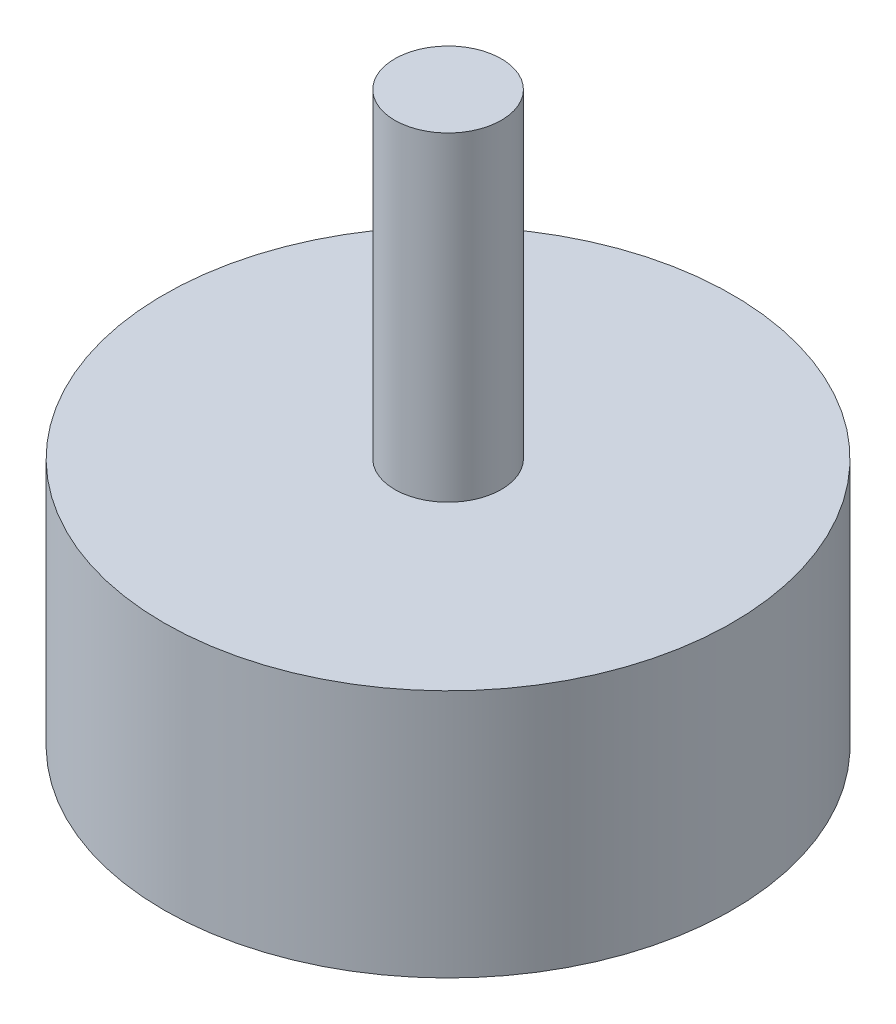
ISO-10303-21;
HEADER;
FILE_DESCRIPTION(('STEP AP214'),'2;1');
FILE_NAME('part.step','',(''),(''),'','','');
FILE_SCHEMA(('AUTOMOTIVE_DESIGN { 1 0 10303 214 1 1 1 1 }'));
ENDSEC;
DATA;
#1=APPLICATION_CONTEXT('core data for automotive mechanical design processes');
#2=APPLICATION_PROTOCOL_DEFINITION('international standard','automotive_design',2000,#1);
#3=PRODUCT_CONTEXT('',#1,'mechanical');
#4=PRODUCT('Part','Part','',(#3));
#5=PRODUCT_RELATED_PRODUCT_CATEGORY('part','',(#4));
#6=PRODUCT_DEFINITION_FORMATION('','',#4);
#7=PRODUCT_DEFINITION_CONTEXT('part definition',#1,'design');
#8=PRODUCT_DEFINITION('design','',#6,#7);
#9=PRODUCT_DEFINITION_SHAPE('','',#8);
#10=(LENGTH_UNIT() NAMED_UNIT(*) SI_UNIT(.MILLI.,.METRE.));
#11=(NAMED_UNIT(*) PLANE_ANGLE_UNIT() SI_UNIT($,.RADIAN.));
#12=(NAMED_UNIT(*) SI_UNIT($,.STERADIAN.) SOLID_ANGLE_UNIT());
#13=UNCERTAINTY_MEASURE_WITH_UNIT(LENGTH_MEASURE(1.E-05),#10,'distance_accuracy_value','');
#14=(GEOMETRIC_REPRESENTATION_CONTEXT(3) GLOBAL_UNCERTAINTY_ASSIGNED_CONTEXT((#13)) GLOBAL_UNIT_ASSIGNED_CONTEXT((#10,
#11,#12)) REPRESENTATION_CONTEXT('',''));
#15=CARTESIAN_POINT('',(0.,0.,0.));
#16=DIRECTION('',(0.,0.,1.));
#17=DIRECTION('',(1.,0.,0.));
#18=AXIS2_PLACEMENT_3D('',#15,#16,#17);
#19=CARTESIAN_POINT('',(0.,11.1125,0.));
#20=DIRECTION('',(0.,1.,0.));
#21=DIRECTION('',(0.,0.,1.));
#22=AXIS2_PLACEMENT_3D('',#19,#20,#21);
#23=PLANE('',#22);
#24=CARTESIAN_POINT('',(0.,11.1125,0.));
#25=DIRECTION('',(0.,1.,0.));
#26=DIRECTION('',(0.,0.,1.));
#27=AXIS2_PLACEMENT_3D('',#24,#25,#26);
#28=CIRCLE('',#27,25.4);
#29=CARTESIAN_POINT('',(0.,11.1125,25.4));
#30=VERTEX_POINT('',#29);
#31=EDGE_CURVE('E12',#30,#30,#28,.T.);
#32=ORIENTED_EDGE('',*,*,#31,.T.);
#33=EDGE_LOOP('',(#32));
#34=FACE_BOUND('',#33,.T.);
#35=CARTESIAN_POINT('',(0.,11.1125,0.));
#36=DIRECTION('',(0.,1.,0.));
#37=DIRECTION('',(0.,0.,1.));
#38=AXIS2_PLACEMENT_3D('',#35,#36,#37);
#39=CIRCLE('',#38,4.7625);
#40=CARTESIAN_POINT('',(0.,11.1125,4.7625));
#41=VERTEX_POINT('',#40);
#42=EDGE_CURVE('E49',#41,#41,#39,.T.);
#43=ORIENTED_EDGE('',*,*,#42,.F.);
#44=EDGE_LOOP('',(#43));
#45=FACE_BOUND('',#44,.T.);
#46=ADVANCED_FACE('F36',(#34,#45),#23,.T.);
#47=CARTESIAN_POINT('',(0.,11.1125,0.));
#48=DIRECTION('',(0.,-1.,0.));
#49=DIRECTION('',(0.,0.,-1.));
#50=AXIS2_PLACEMENT_3D('',#47,#48,#49);
#51=CYLINDRICAL_SURFACE('',#50,25.4);
#52=ORIENTED_EDGE('',*,*,#31,.F.);
#53=EDGE_LOOP('',(#52));
#54=FACE_BOUND('',#53,.T.);
#55=CARTESIAN_POINT('',(0.,-11.1125,0.));
#56=DIRECTION('',(0.,1.,0.));
#57=DIRECTION('',(0.,0.,1.));
#58=AXIS2_PLACEMENT_3D('',#55,#56,#57);
#59=CIRCLE('',#58,25.4);
#60=CARTESIAN_POINT('',(0.,-11.1125,25.4));
#61=VERTEX_POINT('',#60);
#62=EDGE_CURVE('E40',#61,#61,#59,.T.);
#63=ORIENTED_EDGE('',*,*,#62,.T.);
#64=EDGE_LOOP('',(#63));
#65=FACE_BOUND('',#64,.T.);
#66=ADVANCED_FACE('F38',(#54,#65),#51,.T.);
#67=CARTESIAN_POINT('',(0.,-11.1125,0.));
#68=DIRECTION('',(0.,1.,0.));
#69=DIRECTION('',(0.,0.,1.));
#70=AXIS2_PLACEMENT_3D('',#67,#68,#69);
#71=PLANE('',#70);
#72=CARTESIAN_POINT('',(0.,-11.1125,0.));
#73=DIRECTION('',(0.,1.,0.));
#74=DIRECTION('',(0.,0.,1.));
#75=AXIS2_PLACEMENT_3D('',#72,#73,#74);
#76=CIRCLE('',#75,4.7625);
#77=CARTESIAN_POINT('',(0.,-11.1125,4.7625));
#78=VERTEX_POINT('',#77);
#79=EDGE_CURVE('E52',#78,#78,#76,.T.);
#80=ORIENTED_EDGE('',*,*,#79,.T.);
#81=EDGE_LOOP('',(#80));
#82=FACE_BOUND('',#81,.T.);
#83=ORIENTED_EDGE('',*,*,#62,.F.);
#84=EDGE_LOOP('',(#83));
#85=FACE_BOUND('',#84,.T.);
#86=ADVANCED_FACE('F70',(#82,#85),#71,.F.);
#87=CARTESIAN_POINT('',(0.,39.6875,0.));
#88=DIRECTION('',(0.,-1.,0.));
#89=DIRECTION('',(0.,0.,-1.));
#90=AXIS2_PLACEMENT_3D('',#87,#88,#89);
#91=CYLINDRICAL_SURFACE('',#90,4.7625);
#92=CARTESIAN_POINT('',(0.,39.6875,0.));
#93=DIRECTION('',(0.,1.,0.));
#94=DIRECTION('',(0.,0.,1.));
#95=AXIS2_PLACEMENT_3D('',#92,#93,#94);
#96=CIRCLE('',#95,4.7625);
#97=CARTESIAN_POINT('',(0.,39.6875,4.7625));
#98=VERTEX_POINT('',#97);
#99=EDGE_CURVE('E47',#98,#98,#96,.T.);
#100=ORIENTED_EDGE('',*,*,#99,.F.);
#101=EDGE_LOOP('',(#100));
#102=FACE_BOUND('',#101,.T.);
#103=ORIENTED_EDGE('',*,*,#42,.T.);
#104=EDGE_LOOP('',(#103));
#105=FACE_BOUND('',#104,.T.);
#106=ADVANCED_FACE('F73',(#102,#105),#91,.T.);
#107=CARTESIAN_POINT('',(0.,39.6875,0.));
#108=DIRECTION('',(0.,1.,0.));
#109=DIRECTION('',(0.,0.,1.));
#110=AXIS2_PLACEMENT_3D('',#107,#108,#109);
#111=PLANE('',#110);
#112=ORIENTED_EDGE('',*,*,#99,.T.);
#113=EDGE_LOOP('',(#112));
#114=FACE_BOUND('',#113,.T.);
#115=ADVANCED_FACE('F66',(#114),#111,.T.);
#116=CARTESIAN_POINT('',(0.,-39.6875,0.));
#117=DIRECTION('',(0.,1.,0.));
#118=DIRECTION('',(0.,0.,1.));
#119=AXIS2_PLACEMENT_3D('',#116,#117,#118);
#120=CYLINDRICAL_SURFACE('',#119,4.7625);
#121=CARTESIAN_POINT('',(0.,-23.8125,0.));
#122=DIRECTION('',(0.,1.,0.));
#123=DIRECTION('',(0.,0.,1.));
#124=AXIS2_PLACEMENT_3D('',#121,#122,#123);
#125=CIRCLE('',#124,4.7625);
#126=CARTESIAN_POINT('',(0.,-23.8125,4.7625));
#127=VERTEX_POINT('',#126);
#128=EDGE_CURVE('E57',#127,#127,#125,.F.);
#129=ORIENTED_EDGE('',*,*,#128,.F.);
#130=EDGE_LOOP('',(#129));
#131=FACE_BOUND('',#130,.T.);
#132=ORIENTED_EDGE('',*,*,#79,.F.);
#133=EDGE_LOOP('',(#132));
#134=FACE_BOUND('',#133,.T.);
#135=ADVANCED_FACE('F63',(#131,#134),#120,.T.);
#136=CARTESIAN_POINT('',(0.,-23.8125,0.));
#137=DIRECTION('',(0.,1.,0.));
#138=DIRECTION('',(0.,0.,1.));
#139=AXIS2_PLACEMENT_3D('',#136,#137,#138);
#140=PLANE('',#139);
#141=ORIENTED_EDGE('',*,*,#128,.T.);
#142=EDGE_LOOP('',(#141));
#143=FACE_BOUND('',#142,.T.);
#144=ADVANCED_FACE('F61',(#143),#140,.F.);
#145=CLOSED_SHELL('',(#46,#66,#86,#106,#115,#135,#144));
#146=MANIFOLD_SOLID_BREP('B2',#145);
#147=ADVANCED_BREP_SHAPE_REPRESENTATION('',(#18,#146),#14);
#148=SHAPE_DEFINITION_REPRESENTATION(#9,#147);
ENDSEC;
END-ISO-10303-21;
